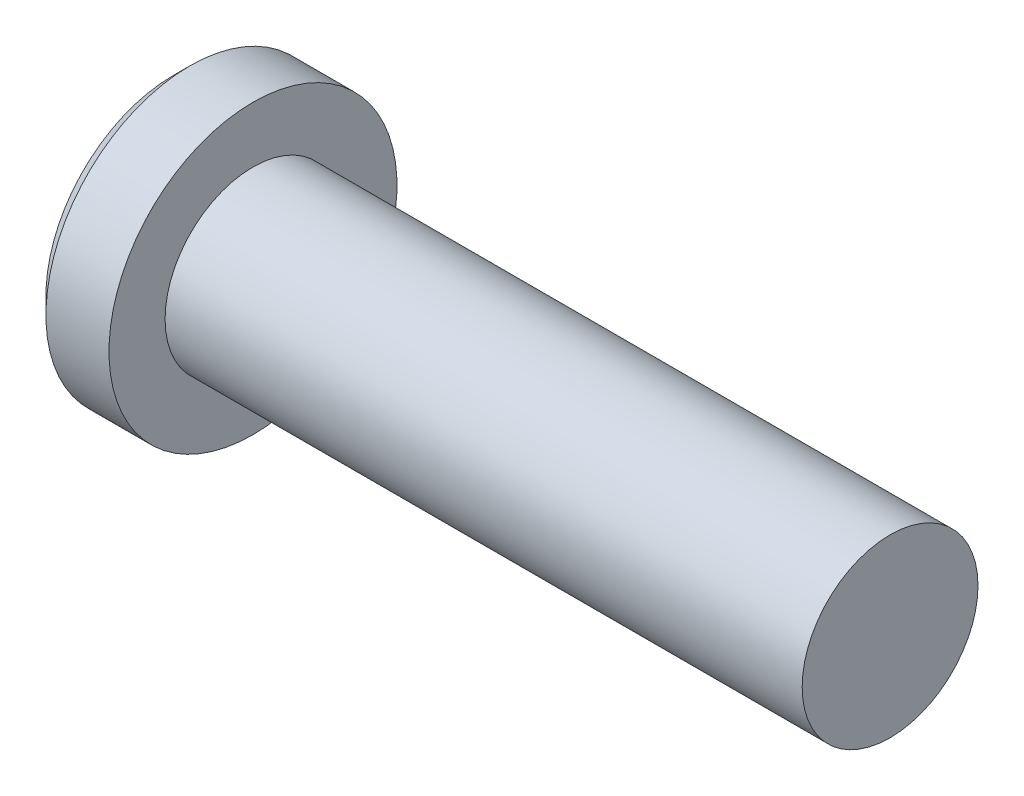
ISO-10303-21;
HEADER;
FILE_DESCRIPTION(('STEP AP214'),'2;1');
FILE_NAME('part.step','',(''),(''),'','','');
FILE_SCHEMA(('AUTOMOTIVE_DESIGN { 1 0 10303 214 1 1 1 1 }'));
ENDSEC;
DATA;
#1=APPLICATION_CONTEXT('core data for automotive mechanical design processes');
#2=APPLICATION_PROTOCOL_DEFINITION('international standard','automotive_design',2000,#1);
#3=PRODUCT_CONTEXT('',#1,'mechanical');
#4=PRODUCT('Part','Part','',(#3));
#5=PRODUCT_RELATED_PRODUCT_CATEGORY('part','',(#4));
#6=PRODUCT_DEFINITION_FORMATION('','',#4);
#7=PRODUCT_DEFINITION_CONTEXT('part definition',#1,'design');
#8=PRODUCT_DEFINITION('design','',#6,#7);
#9=PRODUCT_DEFINITION_SHAPE('','',#8);
#10=(LENGTH_UNIT() NAMED_UNIT(*) SI_UNIT(.MILLI.,.METRE.));
#11=(NAMED_UNIT(*) PLANE_ANGLE_UNIT() SI_UNIT($,.RADIAN.));
#12=(NAMED_UNIT(*) SI_UNIT($,.STERADIAN.) SOLID_ANGLE_UNIT());
#13=UNCERTAINTY_MEASURE_WITH_UNIT(LENGTH_MEASURE(1.E-05),#10,'distance_accuracy_value','');
#14=(GEOMETRIC_REPRESENTATION_CONTEXT(3) GLOBAL_UNCERTAINTY_ASSIGNED_CONTEXT((#13)) GLOBAL_UNIT_ASSIGNED_CONTEXT((#10,
#11,#12)) REPRESENTATION_CONTEXT('',''));
#15=CARTESIAN_POINT('',(0.,0.,0.));
#16=DIRECTION('',(0.,0.,1.));
#17=DIRECTION('',(1.,0.,0.));
#18=AXIS2_PLACEMENT_3D('',#15,#16,#17);
#19=CARTESIAN_POINT('',(-6.35,0.,0.));
#20=DIRECTION('',(1.,0.,0.));
#21=DIRECTION('',(0.,0.,-1.));
#22=AXIS2_PLACEMENT_3D('',#19,#20,#21);
#23=CYLINDRICAL_SURFACE('',#22,1.7526);
#24=CARTESIAN_POINT('',(-6.35,0.,0.));
#25=DIRECTION('',(1.,0.,0.));
#26=DIRECTION('',(0.,1.,0.));
#27=AXIS2_PLACEMENT_3D('',#24,#25,#26);
#28=CIRCLE('',#27,1.7526);
#29=CARTESIAN_POINT('',(-6.35,1.75259999999999,0.));
#30=VERTEX_POINT('',#29);
#31=EDGE_CURVE('E41',#30,#30,#28,.F.);
#32=ORIENTED_EDGE('',*,*,#31,.F.);
#33=EDGE_LOOP('',(#32));
#34=FACE_BOUND('',#33,.T.);
#35=CARTESIAN_POINT('',(6.35,0.,0.));
#36=DIRECTION('',(1.,0.,0.));
#37=DIRECTION('',(0.,0.,-1.));
#38=AXIS2_PLACEMENT_3D('',#35,#36,#37);
#39=CIRCLE('',#38,1.7526);
#40=CARTESIAN_POINT('',(6.35,0.,-1.7526));
#41=VERTEX_POINT('',#40);
#42=EDGE_CURVE('E10',#41,#41,#39,.T.);
#43=ORIENTED_EDGE('',*,*,#42,.F.);
#44=EDGE_LOOP('',(#43));
#45=FACE_BOUND('',#44,.T.);
#46=ADVANCED_FACE('F35',(#34,#45),#23,.T.);
#47=CARTESIAN_POINT('',(6.35,0.,0.));
#48=DIRECTION('',(1.,0.,0.));
#49=DIRECTION('',(0.,0.,-1.));
#50=AXIS2_PLACEMENT_3D('',#47,#48,#49);
#51=PLANE('',#50);
#52=ORIENTED_EDGE('',*,*,#42,.T.);
#53=EDGE_LOOP('',(#52));
#54=FACE_BOUND('',#53,.T.);
#55=ADVANCED_FACE('F63',(#54),#51,.T.);
#56=CARTESIAN_POINT('',(-6.35,0.,0.));
#57=DIRECTION('',(1.,0.,0.));
#58=DIRECTION('',(0.,1.,0.));
#59=AXIS2_PLACEMENT_3D('',#56,#57,#58);
#60=CYLINDRICAL_SURFACE('',#59,2.8702);
#61=CARTESIAN_POINT('',(-7.6073,0.,0.));
#62=DIRECTION('',(1.,0.,0.));
#63=DIRECTION('',(0.,1.,0.));
#64=AXIS2_PLACEMENT_3D('',#61,#62,#63);
#65=CIRCLE('',#64,2.8702);
#66=CARTESIAN_POINT('',(-7.6073,2.8702,0.));
#67=VERTEX_POINT('',#66);
#68=EDGE_CURVE('E45',#67,#67,#65,.T.);
#69=ORIENTED_EDGE('',*,*,#68,.T.);
#70=EDGE_LOOP('',(#69));
#71=FACE_BOUND('',#70,.T.);
#72=CARTESIAN_POINT('',(-6.35,0.,0.));
#73=DIRECTION('',(1.,0.,0.));
#74=DIRECTION('',(0.,1.,0.));
#75=AXIS2_PLACEMENT_3D('',#72,#73,#74);
#76=CIRCLE('',#75,2.8702);
#77=CARTESIAN_POINT('',(-6.35,2.8702,0.));
#78=VERTEX_POINT('',#77);
#79=EDGE_CURVE('E54',#78,#78,#76,.T.);
#80=ORIENTED_EDGE('',*,*,#79,.F.);
#81=EDGE_LOOP('',(#80));
#82=FACE_BOUND('',#81,.T.);
#83=ADVANCED_FACE('F60',(#71,#82),#60,.T.);
#84=CARTESIAN_POINT('',(-7.6073,0.,0.));
#85=DIRECTION('',(1.,0.,0.));
#86=DIRECTION('',(0.,1.,0.));
#87=AXIS2_PLACEMENT_3D('',#84,#85,#86);
#88=CONICAL_SURFACE('',#87,2.8702,0.78539816339745);
#89=CARTESIAN_POINT('',(-7.9375,0.,0.));
#90=DIRECTION('',(1.,0.,0.));
#91=DIRECTION('',(0.,1.,0.));
#92=AXIS2_PLACEMENT_3D('',#89,#90,#91);
#93=CIRCLE('',#92,2.54);
#94=CARTESIAN_POINT('',(-7.9375,2.54,0.));
#95=VERTEX_POINT('',#94);
#96=EDGE_CURVE('E49',#95,#95,#93,.T.);
#97=ORIENTED_EDGE('',*,*,#96,.T.);
#98=EDGE_LOOP('',(#97));
#99=FACE_BOUND('',#98,.T.);
#100=ORIENTED_EDGE('',*,*,#68,.F.);
#101=EDGE_LOOP('',(#100));
#102=FACE_BOUND('',#101,.T.);
#103=ADVANCED_FACE('F62',(#99,#102),#88,.T.);
#104=CARTESIAN_POINT('',(-7.9375,2.54,0.));
#105=DIRECTION('',(-1.,0.,0.));
#106=DIRECTION('',(0.,-1.,0.));
#107=AXIS2_PLACEMENT_3D('',#104,#105,#106);
#108=PLANE('',#107);
#109=ORIENTED_EDGE('',*,*,#96,.F.);
#110=EDGE_LOOP('',(#109));
#111=FACE_BOUND('',#110,.T.);
#112=ADVANCED_FACE('F70',(#111),#108,.T.);
#113=CARTESIAN_POINT('',(-6.35,2.8702,0.));
#114=DIRECTION('',(1.,0.,0.));
#115=DIRECTION('',(0.,1.,0.));
#116=AXIS2_PLACEMENT_3D('',#113,#114,#115);
#117=PLANE('',#116);
#118=ORIENTED_EDGE('',*,*,#31,.T.);
#119=EDGE_LOOP('',(#118));
#120=FACE_BOUND('',#119,.T.);
#121=ORIENTED_EDGE('',*,*,#79,.T.);
#122=EDGE_LOOP('',(#121));
#123=FACE_BOUND('',#122,.T.);
#124=ADVANCED_FACE('F58',(#120,#123),#117,.T.);
#125=CLOSED_SHELL('',(#46,#55,#83,#103,#112,#124));
#126=MANIFOLD_SOLID_BREP('B2',#125);
#127=ADVANCED_BREP_SHAPE_REPRESENTATION('',(#18,#126),#14);
#128=SHAPE_DEFINITION_REPRESENTATION(#9,#127);
ENDSEC;
END-ISO-10303-21;
